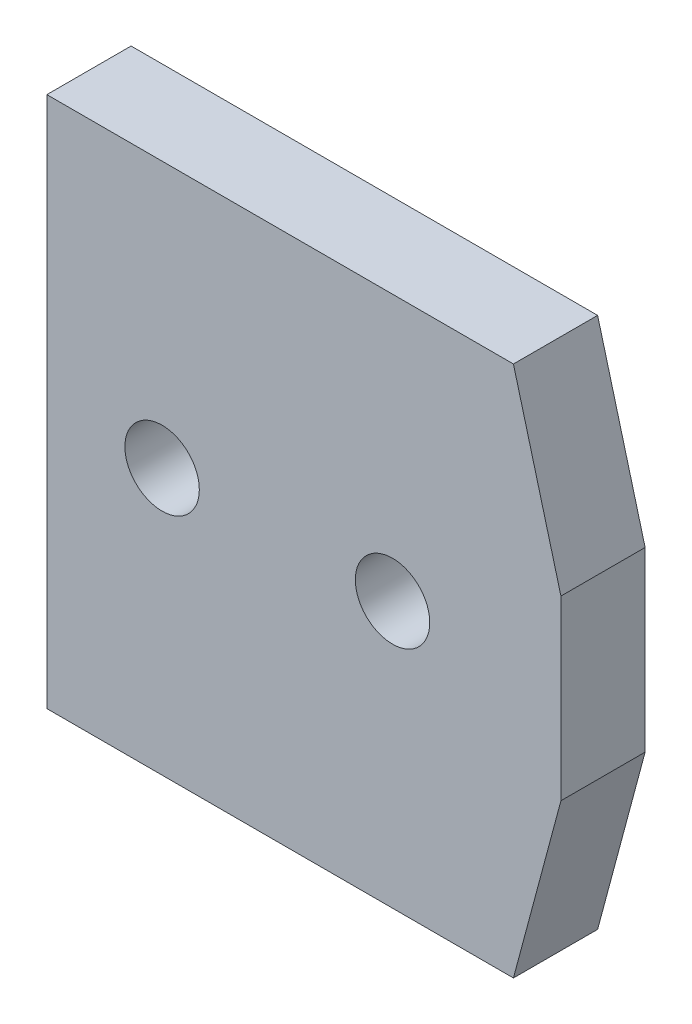
ISO-10303-21;
HEADER;
FILE_DESCRIPTION(('STEP AP214'),'2;1');
FILE_NAME('part.step','',(''),(''),'','','');
FILE_SCHEMA(('AUTOMOTIVE_DESIGN { 1 0 10303 214 1 1 1 1 }'));
ENDSEC;
DATA;
#1=APPLICATION_CONTEXT('core data for automotive mechanical design processes');
#2=APPLICATION_PROTOCOL_DEFINITION('international standard','automotive_design',2000,#1);
#3=PRODUCT_CONTEXT('',#1,'mechanical');
#4=PRODUCT('Part','Part','',(#3));
#5=PRODUCT_RELATED_PRODUCT_CATEGORY('part','',(#4));
#6=PRODUCT_DEFINITION_FORMATION('','',#4);
#7=PRODUCT_DEFINITION_CONTEXT('part definition',#1,'design');
#8=PRODUCT_DEFINITION('design','',#6,#7);
#9=PRODUCT_DEFINITION_SHAPE('','',#8);
#10=(LENGTH_UNIT() NAMED_UNIT(*) SI_UNIT(.MILLI.,.METRE.));
#11=(NAMED_UNIT(*) PLANE_ANGLE_UNIT() SI_UNIT($,.RADIAN.));
#12=(NAMED_UNIT(*) SI_UNIT($,.STERADIAN.) SOLID_ANGLE_UNIT());
#13=UNCERTAINTY_MEASURE_WITH_UNIT(LENGTH_MEASURE(1.E-05),#10,'distance_accuracy_value','');
#14=(GEOMETRIC_REPRESENTATION_CONTEXT(3) GLOBAL_UNCERTAINTY_ASSIGNED_CONTEXT((#13)) GLOBAL_UNIT_ASSIGNED_CONTEXT((#10,
#11,#12)) REPRESENTATION_CONTEXT('',''));
#15=CARTESIAN_POINT('',(0.,0.,0.));
#16=DIRECTION('',(0.,0.,1.));
#17=DIRECTION('',(1.,0.,0.));
#18=AXIS2_PLACEMENT_3D('',#15,#16,#17);
#19=CARTESIAN_POINT('',(0.,0.,4.75));
#20=DIRECTION('',(0.,0.,1.));
#21=DIRECTION('',(1.,0.,0.));
#22=AXIS2_PLACEMENT_3D('',#19,#20,#21);
#23=PLANE('',#22);
#24=CARTESIAN_POINT('',(5.,0.,4.75));
#25=DIRECTION('',(0.,0.,1.));
#26=DIRECTION('',(1.,0.,0.));
#27=AXIS2_PLACEMENT_3D('',#24,#25,#26);
#28=CIRCLE('',#27,2.1);
#29=CARTESIAN_POINT('',(7.1,0.,4.75));
#30=VERTEX_POINT('',#29);
#31=EDGE_CURVE('E164',#30,#30,#28,.T.);
#32=ORIENTED_EDGE('',*,*,#31,.F.);
#33=EDGE_LOOP('',(#32));
#34=FACE_BOUND('',#33,.T.);
#35=DIRECTION('',(-1.,0.,0.));
#36=VECTOR('',#35,1.);
#37=CARTESIAN_POINT('',(11.820508075689,15.,4.75));
#38=LINE('',#37,#36);
#39=CARTESIAN_POINT('',(11.820508075689,15.,4.75));
#40=VERTEX_POINT('',#39);
#41=CARTESIAN_POINT('',(-14.5,15.,4.75));
#42=VERTEX_POINT('',#41);
#43=EDGE_CURVE('E171',#40,#42,#38,.T.);
#44=ORIENTED_EDGE('',*,*,#43,.T.);
#45=DIRECTION('',(0.,-1.,0.));
#46=VECTOR('',#45,1.);
#47=CARTESIAN_POINT('',(-14.5,15.,4.75));
#48=LINE('',#47,#46);
#49=CARTESIAN_POINT('',(-14.5,-15.,4.75));
#50=VERTEX_POINT('',#49);
#51=EDGE_CURVE('E129',#42,#50,#48,.T.);
#52=ORIENTED_EDGE('',*,*,#51,.T.);
#53=DIRECTION('',(1.,0.,0.));
#54=VECTOR('',#53,1.);
#55=CARTESIAN_POINT('',(-14.5,-15.,4.75));
#56=LINE('',#55,#54);
#57=CARTESIAN_POINT('',(11.820508075689,-15.,4.75));
#58=VERTEX_POINT('',#57);
#59=EDGE_CURVE('E142',#50,#58,#56,.T.);
#60=ORIENTED_EDGE('',*,*,#59,.T.);
#61=DIRECTION('',(0.2588190451025,0.965925826289074,0.));
#62=VECTOR('',#61,1.);
#63=CARTESIAN_POINT('',(11.820508075689,-15.,4.75));
#64=LINE('',#63,#62);
#65=CARTESIAN_POINT('',(14.5,-5.,4.75));
#66=VERTEX_POINT('',#65);
#67=EDGE_CURVE('E136',#58,#66,#64,.T.);
#68=ORIENTED_EDGE('',*,*,#67,.T.);
#69=DIRECTION('',(0.,1.,0.));
#70=VECTOR('',#69,1.);
#71=CARTESIAN_POINT('',(14.5,-5.,4.75));
#72=LINE('',#71,#70);
#73=CARTESIAN_POINT('',(14.5,5.,4.75));
#74=VERTEX_POINT('',#73);
#75=EDGE_CURVE('E140',#66,#74,#72,.T.);
#76=ORIENTED_EDGE('',*,*,#75,.T.);
#77=DIRECTION('',(-0.2588190451025,0.965925826289074,0.));
#78=VECTOR('',#77,1.);
#79=CARTESIAN_POINT('',(14.5,5.,4.75));
#80=LINE('',#79,#78);
#81=EDGE_CURVE('E92',#74,#40,#80,.T.);
#82=ORIENTED_EDGE('',*,*,#81,.T.);
#83=EDGE_LOOP('',(#44,#52,#60,#68,#76,#82));
#84=FACE_BOUND('',#83,.T.);
#85=CARTESIAN_POINT('',(-8.,0.,4.75));
#86=DIRECTION('',(0.,0.,1.));
#87=DIRECTION('',(1.,0.,0.));
#88=AXIS2_PLACEMENT_3D('',#85,#86,#87);
#89=CIRCLE('',#88,2.1);
#90=CARTESIAN_POINT('',(-5.9,0.,4.75));
#91=VERTEX_POINT('',#90);
#92=EDGE_CURVE('E213',#91,#91,#89,.T.);
#93=ORIENTED_EDGE('',*,*,#92,.F.);
#94=EDGE_LOOP('',(#93));
#95=FACE_BOUND('',#94,.T.);
#96=ADVANCED_FACE('F75',(#34,#84,#95),#23,.T.);
#97=CARTESIAN_POINT('',(0.,0.,0.));
#98=DIRECTION('',(0.,0.,1.));
#99=DIRECTION('',(1.,0.,0.));
#100=AXIS2_PLACEMENT_3D('',#97,#98,#99);
#101=PLANE('',#100);
#102=DIRECTION('',(-1.,0.,0.));
#103=VECTOR('',#102,1.);
#104=CARTESIAN_POINT('',(11.820508075689,15.,0.));
#105=LINE('',#104,#103);
#106=CARTESIAN_POINT('',(11.820508075689,15.,0.));
#107=VERTEX_POINT('',#106);
#108=CARTESIAN_POINT('',(-14.5,15.,0.));
#109=VERTEX_POINT('',#108);
#110=EDGE_CURVE('E160',#107,#109,#105,.T.);
#111=ORIENTED_EDGE('',*,*,#110,.F.);
#112=DIRECTION('',(-0.2588190451025,0.965925826289074,0.));
#113=VECTOR('',#112,1.);
#114=CARTESIAN_POINT('',(14.5,5.,0.));
#115=LINE('',#114,#113);
#116=CARTESIAN_POINT('',(14.5,5.,0.));
#117=VERTEX_POINT('',#116);
#118=EDGE_CURVE('E121',#117,#107,#115,.T.);
#119=ORIENTED_EDGE('',*,*,#118,.F.);
#120=DIRECTION('',(0.,1.,0.));
#121=VECTOR('',#120,1.);
#122=CARTESIAN_POINT('',(14.5,-5.,0.));
#123=LINE('',#122,#121);
#124=CARTESIAN_POINT('',(14.5,-5.,0.));
#125=VERTEX_POINT('',#124);
#126=EDGE_CURVE('E115',#125,#117,#123,.T.);
#127=ORIENTED_EDGE('',*,*,#126,.F.);
#128=DIRECTION('',(0.2588190451025,0.965925826289074,0.));
#129=VECTOR('',#128,1.);
#130=CARTESIAN_POINT('',(11.820508075689,-15.,0.));
#131=LINE('',#130,#129);
#132=CARTESIAN_POINT('',(11.820508075689,-15.,0.));
#133=VERTEX_POINT('',#132);
#134=EDGE_CURVE('E150',#133,#125,#131,.T.);
#135=ORIENTED_EDGE('',*,*,#134,.F.);
#136=DIRECTION('',(1.,0.,0.));
#137=VECTOR('',#136,1.);
#138=CARTESIAN_POINT('',(-14.5,-15.,0.));
#139=LINE('',#138,#137);
#140=CARTESIAN_POINT('',(-14.5,-15.,0.));
#141=VERTEX_POINT('',#140);
#142=EDGE_CURVE('E166',#141,#133,#139,.T.);
#143=ORIENTED_EDGE('',*,*,#142,.F.);
#144=DIRECTION('',(0.,-1.,0.));
#145=VECTOR('',#144,1.);
#146=CARTESIAN_POINT('',(-14.5,15.,0.));
#147=LINE('',#146,#145);
#148=EDGE_CURVE('E163',#109,#141,#147,.T.);
#149=ORIENTED_EDGE('',*,*,#148,.F.);
#150=EDGE_LOOP('',(#111,#119,#127,#135,#143,#149));
#151=FACE_BOUND('',#150,.T.);
#152=CARTESIAN_POINT('',(5.,0.,0.));
#153=DIRECTION('',(0.,0.,1.));
#154=DIRECTION('',(1.,0.,0.));
#155=AXIS2_PLACEMENT_3D('',#152,#153,#154);
#156=CIRCLE('',#155,2.1);
#157=CARTESIAN_POINT('',(7.1,0.,0.));
#158=VERTEX_POINT('',#157);
#159=EDGE_CURVE('E219',#158,#158,#156,.T.);
#160=ORIENTED_EDGE('',*,*,#159,.T.);
#161=EDGE_LOOP('',(#160));
#162=FACE_BOUND('',#161,.T.);
#163=CARTESIAN_POINT('',(-8.,0.,0.));
#164=DIRECTION('',(0.,0.,1.));
#165=DIRECTION('',(1.,0.,0.));
#166=AXIS2_PLACEMENT_3D('',#163,#164,#165);
#167=CIRCLE('',#166,2.1);
#168=CARTESIAN_POINT('',(-5.9,0.,0.));
#169=VERTEX_POINT('',#168);
#170=EDGE_CURVE('E216',#169,#169,#167,.T.);
#171=ORIENTED_EDGE('',*,*,#170,.T.);
#172=EDGE_LOOP('',(#171));
#173=FACE_BOUND('',#172,.T.);
#174=ADVANCED_FACE('F180',(#151,#162,#173),#101,.F.);
#175=CARTESIAN_POINT('',(11.820508075689,15.,4.75));
#176=DIRECTION('',(0.,-1.,0.));
#177=DIRECTION('',(0.,0.,-1.));
#178=AXIS2_PLACEMENT_3D('',#175,#176,#177);
#179=PLANE('',#178);
#180=ORIENTED_EDGE('',*,*,#110,.T.);
#181=DIRECTION('',(0.,0.,-1.));
#182=VECTOR('',#181,1.);
#183=CARTESIAN_POINT('',(-14.5,15.,4.75));
#184=LINE('',#183,#182);
#185=EDGE_CURVE('E12',#42,#109,#184,.T.);
#186=ORIENTED_EDGE('',*,*,#185,.F.);
#187=ORIENTED_EDGE('',*,*,#43,.F.);
#188=DIRECTION('',(0.,0.,-1.));
#189=VECTOR('',#188,1.);
#190=CARTESIAN_POINT('',(11.820508075689,15.,4.75));
#191=LINE('',#190,#189);
#192=EDGE_CURVE('E156',#40,#107,#191,.T.);
#193=ORIENTED_EDGE('',*,*,#192,.T.);
#194=EDGE_LOOP('',(#180,#186,#187,#193));
#195=FACE_BOUND('',#194,.T.);
#196=ADVANCED_FACE('F77',(#195),#179,.F.);
#197=CARTESIAN_POINT('',(-14.5,15.,4.75));
#198=DIRECTION('',(1.,0.,0.));
#199=DIRECTION('',(0.,0.,-1.));
#200=AXIS2_PLACEMENT_3D('',#197,#198,#199);
#201=PLANE('',#200);
#202=ORIENTED_EDGE('',*,*,#148,.T.);
#203=DIRECTION('',(0.,0.,-1.));
#204=VECTOR('',#203,1.);
#205=CARTESIAN_POINT('',(-14.5,-15.,4.75));
#206=LINE('',#205,#204);
#207=EDGE_CURVE('E84',#50,#141,#206,.T.);
#208=ORIENTED_EDGE('',*,*,#207,.F.);
#209=ORIENTED_EDGE('',*,*,#51,.F.);
#210=ORIENTED_EDGE('',*,*,#185,.T.);
#211=EDGE_LOOP('',(#202,#208,#209,#210));
#212=FACE_BOUND('',#211,.T.);
#213=ADVANCED_FACE('F260',(#212),#201,.F.);
#214=CARTESIAN_POINT('',(-14.5,-15.,4.75));
#215=DIRECTION('',(0.,1.,0.));
#216=DIRECTION('',(0.,0.,1.));
#217=AXIS2_PLACEMENT_3D('',#214,#215,#216);
#218=PLANE('',#217);
#219=ORIENTED_EDGE('',*,*,#142,.T.);
#220=DIRECTION('',(0.,0.,-1.));
#221=VECTOR('',#220,1.);
#222=CARTESIAN_POINT('',(11.820508075689,-15.,4.75));
#223=LINE('',#222,#221);
#224=EDGE_CURVE('E151',#58,#133,#223,.T.);
#225=ORIENTED_EDGE('',*,*,#224,.F.);
#226=ORIENTED_EDGE('',*,*,#59,.F.);
#227=ORIENTED_EDGE('',*,*,#207,.T.);
#228=EDGE_LOOP('',(#219,#225,#226,#227));
#229=FACE_BOUND('',#228,.T.);
#230=ADVANCED_FACE('F177',(#229),#218,.F.);
#231=CARTESIAN_POINT('',(11.820508075689,-15.,4.75));
#232=DIRECTION('',(-0.965925826289074,0.2588190451025,0.));
#233=DIRECTION('',(-0.2588190451025,-0.965925826289074,0.));
#234=AXIS2_PLACEMENT_3D('',#231,#232,#233);
#235=PLANE('',#234);
#236=ORIENTED_EDGE('',*,*,#134,.T.);
#237=DIRECTION('',(0.,0.,-1.));
#238=VECTOR('',#237,1.);
#239=CARTESIAN_POINT('',(14.5,-5.,4.75));
#240=LINE('',#239,#238);
#241=EDGE_CURVE('E147',#66,#125,#240,.T.);
#242=ORIENTED_EDGE('',*,*,#241,.F.);
#243=ORIENTED_EDGE('',*,*,#67,.F.);
#244=ORIENTED_EDGE('',*,*,#224,.T.);
#245=EDGE_LOOP('',(#236,#242,#243,#244));
#246=FACE_BOUND('',#245,.T.);
#247=ADVANCED_FACE('F148',(#246),#235,.F.);
#248=CARTESIAN_POINT('',(14.5,-5.,4.75));
#249=DIRECTION('',(-1.,0.,0.));
#250=DIRECTION('',(0.,0.,1.));
#251=AXIS2_PLACEMENT_3D('',#248,#249,#250);
#252=PLANE('',#251);
#253=ORIENTED_EDGE('',*,*,#126,.T.);
#254=DIRECTION('',(0.,0.,-1.));
#255=VECTOR('',#254,1.);
#256=CARTESIAN_POINT('',(14.5,5.,4.75));
#257=LINE('',#256,#255);
#258=EDGE_CURVE('E152',#74,#117,#257,.T.);
#259=ORIENTED_EDGE('',*,*,#258,.F.);
#260=ORIENTED_EDGE('',*,*,#75,.F.);
#261=ORIENTED_EDGE('',*,*,#241,.T.);
#262=EDGE_LOOP('',(#253,#259,#260,#261));
#263=FACE_BOUND('',#262,.T.);
#264=ADVANCED_FACE('F154',(#263),#252,.F.);
#265=CARTESIAN_POINT('',(14.5,5.,4.75));
#266=DIRECTION('',(-0.965925826289074,-0.2588190451025,0.));
#267=DIRECTION('',(0.2588190451025,-0.965925826289074,0.));
#268=AXIS2_PLACEMENT_3D('',#265,#266,#267);
#269=PLANE('',#268);
#270=ORIENTED_EDGE('',*,*,#118,.T.);
#271=ORIENTED_EDGE('',*,*,#192,.F.);
#272=ORIENTED_EDGE('',*,*,#81,.F.);
#273=ORIENTED_EDGE('',*,*,#258,.T.);
#274=EDGE_LOOP('',(#270,#271,#272,#273));
#275=FACE_BOUND('',#274,.T.);
#276=ADVANCED_FACE('F185',(#275),#269,.F.);
#277=CARTESIAN_POINT('',(5.,0.,4.75));
#278=DIRECTION('',(0.,0.,-1.));
#279=DIRECTION('',(-1.,0.,0.));
#280=AXIS2_PLACEMENT_3D('',#277,#278,#279);
#281=CYLINDRICAL_SURFACE('',#280,2.1);
#282=ORIENTED_EDGE('',*,*,#31,.T.);
#283=EDGE_LOOP('',(#282));
#284=FACE_BOUND('',#283,.T.);
#285=ORIENTED_EDGE('',*,*,#159,.F.);
#286=EDGE_LOOP('',(#285));
#287=FACE_BOUND('',#286,.T.);
#288=ADVANCED_FACE('F187',(#284,#287),#281,.F.);
#289=CARTESIAN_POINT('',(-8.,0.,4.75));
#290=DIRECTION('',(0.,0.,-1.));
#291=DIRECTION('',(-1.,0.,0.));
#292=AXIS2_PLACEMENT_3D('',#289,#290,#291);
#293=CYLINDRICAL_SURFACE('',#292,2.1);
#294=ORIENTED_EDGE('',*,*,#92,.T.);
#295=EDGE_LOOP('',(#294));
#296=FACE_BOUND('',#295,.T.);
#297=ORIENTED_EDGE('',*,*,#170,.F.);
#298=EDGE_LOOP('',(#297));
#299=FACE_BOUND('',#298,.T.);
#300=ADVANCED_FACE('F193',(#296,#299),#293,.F.);
#301=CLOSED_SHELL('',(#96,#174,#196,#213,#230,#247,#264,#276,#288,#300));
#302=MANIFOLD_SOLID_BREP('B2',#301);
#303=ADVANCED_BREP_SHAPE_REPRESENTATION('',(#18,#302),#14);
#304=SHAPE_DEFINITION_REPRESENTATION(#9,#303);
ENDSEC;
END-ISO-10303-21;
